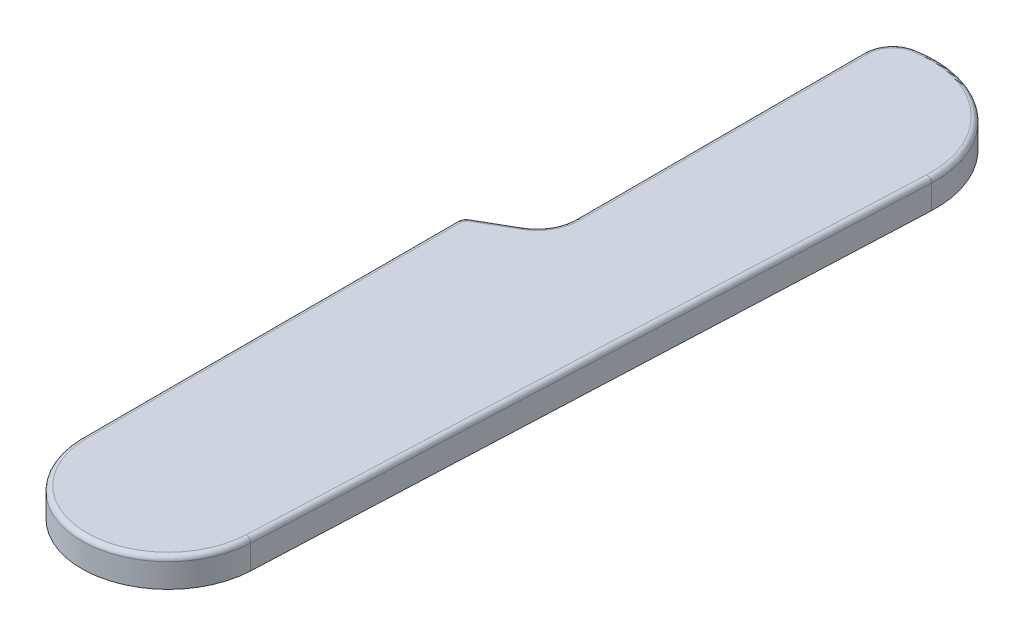
ISO-10303-21;
HEADER;
FILE_DESCRIPTION(('STEP AP214'),'2;1');
FILE_NAME('part.step','',(''),(''),'','','');
FILE_SCHEMA(('AUTOMOTIVE_DESIGN { 1 0 10303 214 1 1 1 1 }'));
ENDSEC;
DATA;
#1=APPLICATION_CONTEXT('core data for automotive mechanical design processes');
#2=APPLICATION_PROTOCOL_DEFINITION('international standard','automotive_design',2000,#1);
#3=PRODUCT_CONTEXT('',#1,'mechanical');
#4=PRODUCT('Part','Part','',(#3));
#5=PRODUCT_RELATED_PRODUCT_CATEGORY('part','',(#4));
#6=PRODUCT_DEFINITION_FORMATION('','',#4);
#7=PRODUCT_DEFINITION_CONTEXT('part definition',#1,'design');
#8=PRODUCT_DEFINITION('design','',#6,#7);
#9=PRODUCT_DEFINITION_SHAPE('','',#8);
#10=(LENGTH_UNIT() NAMED_UNIT(*) SI_UNIT(.MILLI.,.METRE.));
#11=(NAMED_UNIT(*) PLANE_ANGLE_UNIT() SI_UNIT($,.RADIAN.));
#12=(NAMED_UNIT(*) SI_UNIT($,.STERADIAN.) SOLID_ANGLE_UNIT());
#13=UNCERTAINTY_MEASURE_WITH_UNIT(LENGTH_MEASURE(1.E-05),#10,'distance_accuracy_value','');
#14=(GEOMETRIC_REPRESENTATION_CONTEXT(3) GLOBAL_UNCERTAINTY_ASSIGNED_CONTEXT((#13)) GLOBAL_UNIT_ASSIGNED_CONTEXT((#10,
#11,#12)) REPRESENTATION_CONTEXT('',''));
#15=CARTESIAN_POINT('',(0.,0.,0.));
#16=DIRECTION('',(0.,0.,1.));
#17=DIRECTION('',(1.,0.,0.));
#18=AXIS2_PLACEMENT_3D('',#15,#16,#17);
#19=CARTESIAN_POINT('',(-2.99888083783223,3.,-43.087780912381));
#20=DIRECTION('',(-1.,0.,0.));
#21=DIRECTION('',(0.,0.,1.));
#22=AXIS2_PLACEMENT_3D('',#19,#20,#21);
#23=PLANE('',#22);
#24=DIRECTION('',(0.,-1.,0.));
#25=VECTOR('',#24,1.);
#26=CARTESIAN_POINT('',(-2.99888083783231,3.,-45.3971819891395));
#27=LINE('',#26,#25);
#28=CARTESIAN_POINT('',(-2.99888083783231,0.,-45.3971819891395));
#29=VERTEX_POINT('',#28);
#30=CARTESIAN_POINT('',(-2.99888083783231,2.5,-45.3971819891395));
#31=VERTEX_POINT('',#30);
#32=EDGE_CURVE('E189',#29,#31,#27,.F.);
#33=ORIENTED_EDGE('',*,*,#32,.T.);
#34=DIRECTION('',(0.,0.,-1.));
#35=VECTOR('',#34,1.);
#36=CARTESIAN_POINT('',(-2.99888083783227,2.5,-75.448876402048));
#37=LINE('',#36,#35);
#38=CARTESIAN_POINT('',(-2.99888083783227,2.5,-75.448876402048));
#39=VERTEX_POINT('',#38);
#40=EDGE_CURVE('E235',#31,#39,#37,.T.);
#41=ORIENTED_EDGE('',*,*,#40,.T.);
#42=DIRECTION('',(0.,-1.,0.));
#43=VECTOR('',#42,1.);
#44=CARTESIAN_POINT('',(-2.99888083783227,3.,-75.448876402048));
#45=LINE('',#44,#43);
#46=CARTESIAN_POINT('',(-2.99888083783227,0.,-75.448876402048));
#47=VERTEX_POINT('',#46);
#48=EDGE_CURVE('E193',#39,#47,#45,.T.);
#49=ORIENTED_EDGE('',*,*,#48,.T.);
#50=DIRECTION('',(0.,0.,-1.));
#51=VECTOR('',#50,1.);
#52=CARTESIAN_POINT('',(-2.99888083783223,0.,-43.087780912381));
#53=LINE('',#52,#51);
#54=EDGE_CURVE('E170',#29,#47,#53,.T.);
#55=ORIENTED_EDGE('',*,*,#54,.F.);
#56=EDGE_LOOP('',(#33,#41,#49,#55));
#57=FACE_BOUND('',#56,.T.);
#58=ADVANCED_FACE('F48',(#57),#23,.T.);
#59=CARTESIAN_POINT('',(-8.99888083783227,3.,-39.6236792972433));
#60=DIRECTION('',(-0.499999999999998,0.,-0.866025403784441));
#61=DIRECTION('',(-0.866025403784441,0.,0.499999999999998));
#62=AXIS2_PLACEMENT_3D('',#59,#60,#61);
#63=PLANE('',#62);
#64=DIRECTION('',(0.,-1.,0.));
#65=VECTOR('',#64,1.);
#66=CARTESIAN_POINT('',(-8.4988808378323,3.,-39.9123544318381));
#67=LINE('',#66,#65);
#68=CARTESIAN_POINT('',(-8.4988808378323,0.,-39.9123544318381));
#69=VERTEX_POINT('',#68);
#70=CARTESIAN_POINT('',(-8.4988808378323,2.5,-39.9123544318381));
#71=VERTEX_POINT('',#70);
#72=EDGE_CURVE('E202',#69,#71,#67,.F.);
#73=ORIENTED_EDGE('',*,*,#72,.T.);
#74=DIRECTION('',(0.866025403784441,0.,-0.499999999999998));
#75=VECTOR('',#74,1.);
#76=CARTESIAN_POINT('',(-4.99888083783232,2.5,-41.9330803740018));
#77=LINE('',#76,#75);
#78=CARTESIAN_POINT('',(-4.99888083783232,2.5,-41.9330803740018));
#79=VERTEX_POINT('',#78);
#80=EDGE_CURVE('E13',#71,#79,#77,.T.);
#81=ORIENTED_EDGE('',*,*,#80,.T.);
#82=DIRECTION('',(0.,-1.,0.));
#83=VECTOR('',#82,1.);
#84=CARTESIAN_POINT('',(-4.99888083783232,0.,-41.9330803740018));
#85=LINE('',#84,#83);
#86=CARTESIAN_POINT('',(-4.99888083783232,0.,-41.9330803740018));
#87=VERTEX_POINT('',#86);
#88=EDGE_CURVE('E186',#79,#87,#85,.T.);
#89=ORIENTED_EDGE('',*,*,#88,.T.);
#90=DIRECTION('',(0.86602540378444,0.,-0.499999999999998));
#91=VECTOR('',#90,1.);
#92=CARTESIAN_POINT('',(-8.99888083783227,0.,-39.6236792972433));
#93=LINE('',#92,#91);
#94=EDGE_CURVE('E159',#69,#87,#93,.T.);
#95=ORIENTED_EDGE('',*,*,#94,.F.);
#96=EDGE_LOOP('',(#73,#81,#89,#95));
#97=FACE_BOUND('',#96,.T.);
#98=ADVANCED_FACE('F288',(#97),#63,.T.);
#99=CARTESIAN_POINT('',(-8.9988808378323,3.,0.141928385090591));
#100=DIRECTION('',(-1.,0.,0.));
#101=DIRECTION('',(0.,0.,1.));
#102=AXIS2_PLACEMENT_3D('',#99,#100,#101);
#103=PLANE('',#102);
#104=DIRECTION('',(0.,-1.,0.));
#105=VECTOR('',#104,1.);
#106=CARTESIAN_POINT('',(-8.99888083783231,3.,0.141928385090587));
#107=LINE('',#106,#105);
#108=CARTESIAN_POINT('',(-8.99888083783231,2.5,0.141928385090587));
#109=VERTEX_POINT('',#108);
#110=CARTESIAN_POINT('',(-8.99888083783231,0.,0.141928385090587));
#111=VERTEX_POINT('',#110);
#112=EDGE_CURVE('E184',#109,#111,#107,.T.);
#113=ORIENTED_EDGE('',*,*,#112,.F.);
#114=DIRECTION('',(0.,0.,-1.));
#115=VECTOR('',#114,1.);
#116=CARTESIAN_POINT('',(-8.99888083783227,2.5,-39.0463290280537));
#117=LINE('',#116,#115);
#118=CARTESIAN_POINT('',(-8.99888083783227,2.5,-39.0463290280537));
#119=VERTEX_POINT('',#118);
#120=EDGE_CURVE('E204',#109,#119,#117,.T.);
#121=ORIENTED_EDGE('',*,*,#120,.T.);
#122=DIRECTION('',(0.,-1.,0.));
#123=VECTOR('',#122,1.);
#124=CARTESIAN_POINT('',(-8.99888083783227,3.,-39.0463290280537));
#125=LINE('',#124,#123);
#126=CARTESIAN_POINT('',(-8.99888083783227,0.,-39.0463290280537));
#127=VERTEX_POINT('',#126);
#128=EDGE_CURVE('E198',#119,#127,#125,.T.);
#129=ORIENTED_EDGE('',*,*,#128,.T.);
#130=DIRECTION('',(0.,0.,-1.));
#131=VECTOR('',#130,1.);
#132=CARTESIAN_POINT('',(-8.9988808378323,0.,0.141928385090591));
#133=LINE('',#132,#131);
#134=EDGE_CURVE('E177',#111,#127,#133,.T.);
#135=ORIENTED_EDGE('',*,*,#134,.F.);
#136=EDGE_LOOP('',(#113,#121,#129,#135));
#137=FACE_BOUND('',#136,.T.);
#138=ADVANCED_FACE('F294',(#137),#103,.T.);
#139=CARTESIAN_POINT('',(0.,3.,0.));
#140=DIRECTION('',(0.,-1.,0.));
#141=DIRECTION('',(0.,0.,-1.));
#142=AXIS2_PLACEMENT_3D('',#139,#140,#141);
#143=CYLINDRICAL_SURFACE('',#142,9.);
#144=DIRECTION('',(0.,-1.,0.));
#145=VECTOR('',#144,1.);
#146=CARTESIAN_POINT('',(8.99143399423672,3.,0.392574486288027));
#147=LINE('',#146,#145);
#148=CARTESIAN_POINT('',(8.99143399423672,2.5,0.392574486288027));
#149=VERTEX_POINT('',#148);
#150=CARTESIAN_POINT('',(8.99143399423672,0.,0.392574486288027));
#151=VERTEX_POINT('',#150);
#152=EDGE_CURVE('E158',#149,#151,#147,.T.);
#153=ORIENTED_EDGE('',*,*,#152,.F.);
#154=CARTESIAN_POINT('',(0.,2.5,0.));
#155=DIRECTION('',(0.,-1.,0.));
#156=DIRECTION('',(0.,0.,-1.));
#157=AXIS2_PLACEMENT_3D('',#154,#155,#156);
#158=CIRCLE('',#157,9.);
#159=EDGE_CURVE('E228',#149,#109,#158,.T.);
#160=ORIENTED_EDGE('',*,*,#159,.T.);
#161=ORIENTED_EDGE('',*,*,#112,.T.);
#162=CARTESIAN_POINT('',(0.,0.,0.));
#163=DIRECTION('',(0.,1.,0.));
#164=DIRECTION('',(0.,0.,1.));
#165=AXIS2_PLACEMENT_3D('',#162,#163,#164);
#166=CIRCLE('',#165,9.);
#167=EDGE_CURVE('E175',#111,#151,#166,.T.);
#168=ORIENTED_EDGE('',*,*,#167,.T.);
#169=EDGE_LOOP('',(#153,#160,#161,#168));
#170=FACE_BOUND('',#169,.T.);
#171=ADVANCED_FACE('F403',(#170),#143,.T.);
#172=CARTESIAN_POINT('',(8.99143399423672,3.,0.392574486288027));
#173=DIRECTION('',(-0.999048221581858,0.,-0.0436193873653361));
#174=DIRECTION('',(-0.0436193873653361,0.,0.999048221581858));
#175=AXIS2_PLACEMENT_3D('',#172,#173,#174);
#176=PLANE('',#175);
#177=DIRECTION('',(0.,-1.,0.));
#178=VECTOR('',#177,1.);
#179=CARTESIAN_POINT('',(11.9573742369389,3.,-67.5386254632291));
#180=LINE('',#179,#178);
#181=CARTESIAN_POINT('',(11.9573742369389,2.5,-67.5386254632291));
#182=VERTEX_POINT('',#181);
#183=CARTESIAN_POINT('',(11.9573742369389,0.,-67.5386254632291));
#184=VERTEX_POINT('',#183);
#185=EDGE_CURVE('E147',#182,#184,#180,.T.);
#186=ORIENTED_EDGE('',*,*,#185,.F.);
#187=DIRECTION('',(0.0436193873653361,0.,-0.999048221581858));
#188=VECTOR('',#187,1.);
#189=CARTESIAN_POINT('',(8.99143399423672,2.5,0.392574486288027));
#190=LINE('',#189,#188);
#191=EDGE_CURVE('E230',#182,#149,#190,.F.);
#192=ORIENTED_EDGE('',*,*,#191,.T.);
#193=ORIENTED_EDGE('',*,*,#152,.T.);
#194=DIRECTION('',(0.0436193873653361,0.,-0.999048221581858));
#195=VECTOR('',#194,1.);
#196=CARTESIAN_POINT('',(8.99143399423672,0.,0.392574486288027));
#197=LINE('',#196,#195);
#198=EDGE_CURVE('E166',#151,#184,#197,.T.);
#199=ORIENTED_EDGE('',*,*,#198,.T.);
#200=EDGE_LOOP('',(#186,#192,#193,#199));
#201=FACE_BOUND('',#200,.T.);
#202=ADVANCED_FACE('F172',(#201),#176,.F.);
#203=CARTESIAN_POINT('',(1.3901600167217,3.,-68.));
#204=DIRECTION('',(0.,-1.,0.));
#205=DIRECTION('',(0.,0.,-1.));
#206=AXIS2_PLACEMENT_3D('',#203,#204,#205);
#207=CYLINDRICAL_SURFACE('',#206,10.5772814484225);
#208=DIRECTION('',(0.,-1.,0.));
#209=VECTOR('',#208,1.);
#210=CARTESIAN_POINT('',(-0.548830393227166,3.,-78.3980382298426));
#211=LINE('',#210,#209);
#212=CARTESIAN_POINT('',(-0.548830393227166,0.,-78.3980382298426));
#213=VERTEX_POINT('',#212);
#214=CARTESIAN_POINT('',(-0.548830393227166,2.5,-78.3980382298426));
#215=VERTEX_POINT('',#214);
#216=EDGE_CURVE('E196',#213,#215,#211,.F.);
#217=ORIENTED_EDGE('',*,*,#216,.T.);
#218=CARTESIAN_POINT('',(1.3901600167217,2.5,-68.));
#219=DIRECTION('',(0.,-1.,0.));
#220=DIRECTION('',(0.,0.,-1.));
#221=AXIS2_PLACEMENT_3D('',#218,#219,#220);
#222=CIRCLE('',#221,10.5772814484225);
#223=EDGE_CURVE('E154',#215,#182,#222,.T.);
#224=ORIENTED_EDGE('',*,*,#223,.T.);
#225=ORIENTED_EDGE('',*,*,#185,.T.);
#226=CARTESIAN_POINT('',(1.3901600167217,0.,-68.));
#227=DIRECTION('',(0.,-1.,0.));
#228=DIRECTION('',(0.,0.,-1.));
#229=AXIS2_PLACEMENT_3D('',#226,#227,#228);
#230=CIRCLE('',#229,10.5772814484225);
#231=EDGE_CURVE('E151',#213,#184,#230,.T.);
#232=ORIENTED_EDGE('',*,*,#231,.F.);
#233=EDGE_LOOP('',(#217,#224,#225,#232));
#234=FACE_BOUND('',#233,.T.);
#235=ADVANCED_FACE('F150',(#234),#207,.T.);
#236=CARTESIAN_POINT('',(1.3901600167217,3.,-68.));
#237=DIRECTION('',(0.,-1.,0.));
#238=DIRECTION('',(0.,0.,-1.));
#239=AXIS2_PLACEMENT_3D('',#236,#237,#238);
#240=PLANE('',#239);
#241=CARTESIAN_POINT('',(-7.99888083783227,3.,-39.0463290280537));
#242=DIRECTION('',(0.,-1.,0.));
#243=DIRECTION('',(0.,0.,-1.));
#244=AXIS2_PLACEMENT_3D('',#241,#242,#243);
#245=CIRCLE('',#244,0.5);
#246=CARTESIAN_POINT('',(-8.24888083783226,3.,-39.4793417299459));
#247=VERTEX_POINT('',#246);
#248=CARTESIAN_POINT('',(-8.49888083783231,3.,-39.0463290280537));
#249=VERTEX_POINT('',#248);
#250=EDGE_CURVE('E221',#247,#249,#245,.F.);
#251=ORIENTED_EDGE('',*,*,#250,.T.);
#252=DIRECTION('',(0.,0.,-1.));
#253=VECTOR('',#252,1.);
#254=CARTESIAN_POINT('',(-8.49888083783224,3.,0.141928385090612));
#255=LINE('',#254,#253);
#256=CARTESIAN_POINT('',(-8.49888083783227,3.,0.13792934541542));
#257=VERTEX_POINT('',#256);
#258=EDGE_CURVE('E223',#249,#257,#255,.F.);
#259=ORIENTED_EDGE('',*,*,#258,.T.);
#260=CARTESIAN_POINT('',(0.,3.,0.));
#261=DIRECTION('',(0.,-1.,0.));
#262=DIRECTION('',(0.,0.,-1.));
#263=AXIS2_PLACEMENT_3D('',#260,#261,#262);
#264=CIRCLE('',#263,8.5);
#265=CARTESIAN_POINT('',(8.49190988344583,3.,0.370764792605355));
#266=VERTEX_POINT('',#265);
#267=EDGE_CURVE('E219',#257,#266,#264,.F.);
#268=ORIENTED_EDGE('',*,*,#267,.T.);
#269=DIRECTION('',(0.0436193873653361,0.,-0.999048221581858));
#270=VECTOR('',#269,1.);
#271=CARTESIAN_POINT('',(11.4578501261485,3.,-67.5604351569118));
#272=LINE('',#271,#270);
#273=CARTESIAN_POINT('',(11.457850126148,3.,-67.5604351569118));
#274=VERTEX_POINT('',#273);
#275=EDGE_CURVE('E217',#266,#274,#272,.T.);
#276=ORIENTED_EDGE('',*,*,#275,.T.);
#277=CARTESIAN_POINT('',(1.3901600167217,3.,-68.));
#278=DIRECTION('',(0.,-1.,0.));
#279=DIRECTION('',(0.,0.,-1.));
#280=AXIS2_PLACEMENT_3D('',#277,#278,#279);
#281=CIRCLE('',#280,10.0772814484225);
#282=CARTESIAN_POINT('',(-0.457172133994682,3.,-77.9065112585435));
#283=VERTEX_POINT('',#282);
#284=EDGE_CURVE('E215',#274,#283,#281,.F.);
#285=ORIENTED_EDGE('',*,*,#284,.T.);
#286=CARTESIAN_POINT('',(0.00111916216773145,3.,-75.448876402048));
#287=DIRECTION('',(0.,-1.,0.));
#288=DIRECTION('',(0.,0.,-1.));
#289=AXIS2_PLACEMENT_3D('',#286,#287,#288);
#290=CIRCLE('',#289,2.5);
#291=CARTESIAN_POINT('',(-2.49888083783223,3.,-75.448876402048));
#292=VERTEX_POINT('',#291);
#293=EDGE_CURVE('E213',#283,#292,#290,.F.);
#294=ORIENTED_EDGE('',*,*,#293,.T.);
#295=DIRECTION('',(0.,0.,-1.));
#296=VECTOR('',#295,1.);
#297=CARTESIAN_POINT('',(-2.49888083783231,3.,-45.3971819891395));
#298=LINE('',#297,#296);
#299=CARTESIAN_POINT('',(-2.49888083783231,3.,-45.3971819891395));
#300=VERTEX_POINT('',#299);
#301=EDGE_CURVE('E211',#292,#300,#298,.F.);
#302=ORIENTED_EDGE('',*,*,#301,.T.);
#303=CARTESIAN_POINT('',(-6.99888083783227,3.,-45.3971819891395));
#304=DIRECTION('',(0.,-1.,0.));
#305=DIRECTION('',(0.,0.,-1.));
#306=AXIS2_PLACEMENT_3D('',#303,#304,#305);
#307=CIRCLE('',#306,4.5);
#308=CARTESIAN_POINT('',(-4.74888083783225,3.,-41.5000676721096));
#309=VERTEX_POINT('',#308);
#310=EDGE_CURVE('E209',#300,#309,#307,.T.);
#311=ORIENTED_EDGE('',*,*,#310,.T.);
#312=DIRECTION('',(0.866025403784441,0.,-0.499999999999998));
#313=VECTOR('',#312,1.);
#314=CARTESIAN_POINT('',(-8.24888083783225,3.,-39.4793417299459));
#315=LINE('',#314,#313);
#316=EDGE_CURVE('E207',#309,#247,#315,.F.);
#317=ORIENTED_EDGE('',*,*,#316,.T.);
#318=EDGE_LOOP('',(#251,#259,#268,#276,#285,#294,#302,#311,#317));
#319=FACE_BOUND('',#318,.T.);
#320=ADVANCED_FACE('F377',(#319),#240,.F.);
#321=CARTESIAN_POINT('',(1.3901600167217,0.,-68.));
#322=DIRECTION('',(0.,-1.,0.));
#323=DIRECTION('',(0.,0.,-1.));
#324=AXIS2_PLACEMENT_3D('',#321,#322,#323);
#325=PLANE('',#324);
#326=CARTESIAN_POINT('',(6.9164635945933,0.,-69.4822668018044));
#327=DIRECTION('',(0.,-1.,0.));
#328=DIRECTION('',(0.,0.,-1.));
#329=AXIS2_PLACEMENT_3D('',#326,#327,#328);
#330=CIRCLE('',#329,1.00000000000001);
#331=CARTESIAN_POINT('',(6.9164635945933,0.,-70.4822668018044));
#332=VERTEX_POINT('',#331);
#333=EDGE_CURVE('E360',#332,#332,#330,.T.);
#334=ORIENTED_EDGE('',*,*,#333,.F.);
#335=EDGE_LOOP('',(#334));
#336=FACE_BOUND('',#335,.T.);
#337=CARTESIAN_POINT('',(2.7408492822206,0.,-1.61059196528434));
#338=DIRECTION('',(0.,-1.,0.));
#339=DIRECTION('',(0.,0.,-1.));
#340=AXIS2_PLACEMENT_3D('',#337,#338,#339);
#341=CIRCLE('',#340,1.);
#342=CARTESIAN_POINT('',(2.7408492822206,0.,-2.61059196528434));
#343=VERTEX_POINT('',#342);
#344=EDGE_CURVE('E354',#343,#343,#341,.T.);
#345=ORIENTED_EDGE('',*,*,#344,.F.);
#346=EDGE_LOOP('',(#345));
#347=FACE_BOUND('',#346,.T.);
#348=CARTESIAN_POINT('',(-5.99999999999962,0.,-35.3553391064268));
#349=DIRECTION('',(0.,-1.,0.));
#350=DIRECTION('',(0.,0.,-1.));
#351=AXIS2_PLACEMENT_3D('',#348,#349,#350);
#352=CIRCLE('',#351,1.);
#353=CARTESIAN_POINT('',(-5.99999999999962,0.,-36.3553391064268));
#354=VERTEX_POINT('',#353);
#355=EDGE_CURVE('E348',#354,#354,#352,.T.);
#356=ORIENTED_EDGE('',*,*,#355,.F.);
#357=EDGE_LOOP('',(#356));
#358=FACE_BOUND('',#357,.T.);
#359=ORIENTED_EDGE('',*,*,#134,.T.);
#360=CARTESIAN_POINT('',(-7.99888083783227,0.,-39.0463290280537));
#361=DIRECTION('',(0.,-1.,0.));
#362=DIRECTION('',(0.,0.,-1.));
#363=AXIS2_PLACEMENT_3D('',#360,#361,#362);
#364=CIRCLE('',#363,1.);
#365=EDGE_CURVE('E200',#127,#69,#364,.T.);
#366=ORIENTED_EDGE('',*,*,#365,.T.);
#367=ORIENTED_EDGE('',*,*,#94,.T.);
#368=CARTESIAN_POINT('',(-6.99888083783227,0.,-45.3971819891395));
#369=DIRECTION('',(0.,-1.,0.));
#370=DIRECTION('',(0.,0.,-1.));
#371=AXIS2_PLACEMENT_3D('',#368,#369,#370);
#372=CIRCLE('',#371,4.);
#373=EDGE_CURVE('E191',#87,#29,#372,.F.);
#374=ORIENTED_EDGE('',*,*,#373,.T.);
#375=ORIENTED_EDGE('',*,*,#54,.T.);
#376=CARTESIAN_POINT('',(0.00111916216773145,0.,-75.448876402048));
#377=DIRECTION('',(0.,-1.,0.));
#378=DIRECTION('',(0.,0.,-1.));
#379=AXIS2_PLACEMENT_3D('',#376,#377,#378);
#380=CIRCLE('',#379,3.);
#381=EDGE_CURVE('E169',#47,#213,#380,.T.);
#382=ORIENTED_EDGE('',*,*,#381,.T.);
#383=ORIENTED_EDGE('',*,*,#231,.T.);
#384=ORIENTED_EDGE('',*,*,#198,.F.);
#385=ORIENTED_EDGE('',*,*,#167,.F.);
#386=EDGE_LOOP('',(#359,#366,#367,#374,#375,#382,#383,#384,#385));
#387=FACE_BOUND('',#386,.T.);
#388=ADVANCED_FACE('F164',(#336,#347,#358,#387),#325,.T.);
#389=CARTESIAN_POINT('',(-6.99888083783227,3.,-45.3971819891395));
#390=DIRECTION('',(0.,1.,0.));
#391=DIRECTION('',(0.,0.,1.));
#392=AXIS2_PLACEMENT_3D('',#389,#390,#391);
#393=CYLINDRICAL_SURFACE('',#392,4.);
#394=ORIENTED_EDGE('',*,*,#88,.F.);
#395=CARTESIAN_POINT('',(-6.99888083783227,2.5,-45.3971819891395));
#396=DIRECTION('',(0.,-1.,0.));
#397=DIRECTION('',(0.,0.,-1.));
#398=AXIS2_PLACEMENT_3D('',#395,#396,#397);
#399=CIRCLE('',#398,4.);
#400=EDGE_CURVE('E57',#79,#31,#399,.F.);
#401=ORIENTED_EDGE('',*,*,#400,.T.);
#402=ORIENTED_EDGE('',*,*,#32,.F.);
#403=ORIENTED_EDGE('',*,*,#373,.F.);
#404=EDGE_LOOP('',(#394,#401,#402,#403));
#405=FACE_BOUND('',#404,.T.);
#406=ADVANCED_FACE('F299',(#405),#393,.F.);
#407=CARTESIAN_POINT('',(0.00111916216773145,3.,-75.448876402048));
#408=DIRECTION('',(0.,-1.,0.));
#409=DIRECTION('',(0.,0.,-1.));
#410=AXIS2_PLACEMENT_3D('',#407,#408,#409);
#411=CYLINDRICAL_SURFACE('',#410,3.);
#412=ORIENTED_EDGE('',*,*,#48,.F.);
#413=CARTESIAN_POINT('',(0.00111916216773145,2.5,-75.448876402048));
#414=DIRECTION('',(0.,-1.,0.));
#415=DIRECTION('',(0.,0.,-1.));
#416=AXIS2_PLACEMENT_3D('',#413,#414,#415);
#417=CIRCLE('',#416,3.);
#418=EDGE_CURVE('E233',#39,#215,#417,.T.);
#419=ORIENTED_EDGE('',*,*,#418,.T.);
#420=ORIENTED_EDGE('',*,*,#216,.F.);
#421=ORIENTED_EDGE('',*,*,#381,.F.);
#422=EDGE_LOOP('',(#412,#419,#420,#421));
#423=FACE_BOUND('',#422,.T.);
#424=ADVANCED_FACE('F302',(#423),#411,.T.);
#425=CARTESIAN_POINT('',(-7.99888083783227,3.,-39.0463290280537));
#426=DIRECTION('',(0.,-1.,0.));
#427=DIRECTION('',(0.,0.,-1.));
#428=AXIS2_PLACEMENT_3D('',#425,#426,#427);
#429=CYLINDRICAL_SURFACE('',#428,1.);
#430=ORIENTED_EDGE('',*,*,#128,.F.);
#431=CARTESIAN_POINT('',(-7.99888083783227,2.5,-39.0463290280537));
#432=DIRECTION('',(0.,-1.,0.));
#433=DIRECTION('',(0.,0.,-1.));
#434=AXIS2_PLACEMENT_3D('',#431,#432,#433);
#435=CIRCLE('',#434,1.);
#436=EDGE_CURVE('E226',#119,#71,#435,.T.);
#437=ORIENTED_EDGE('',*,*,#436,.T.);
#438=ORIENTED_EDGE('',*,*,#72,.F.);
#439=ORIENTED_EDGE('',*,*,#365,.F.);
#440=EDGE_LOOP('',(#430,#437,#438,#439));
#441=FACE_BOUND('',#440,.T.);
#442=ADVANCED_FACE('F284',(#441),#429,.T.);
#443=CARTESIAN_POINT('',(0.00111916216773145,2.5,-75.448876402048));
#444=DIRECTION('',(0.,-1.,0.));
#445=DIRECTION('',(0.,0.,-1.));
#446=AXIS2_PLACEMENT_3D('',#443,#444,#445);
#447=TOROIDAL_SURFACE('',#446,2.5,0.5);
#448=CARTESIAN_POINT('',(-0.457172133994682,2.5,-77.9065112585435));
#449=DIRECTION('',(0.98305394259821,0.,-0.183316518464966));
#450=DIRECTION('',(-0.183316518464966,0.,-0.98305394259821));
#451=AXIS2_PLACEMENT_3D('',#448,#449,#450);
#452=CIRCLE('',#451,0.5);
#453=EDGE_CURVE('E339',#215,#283,#452,.T.);
#454=ORIENTED_EDGE('',*,*,#453,.F.);
#455=ORIENTED_EDGE('',*,*,#418,.F.);
#456=CARTESIAN_POINT('',(-2.49888083783223,2.5,-75.448876402048));
#457=DIRECTION('',(0.,0.,1.));
#458=DIRECTION('',(1.,0.,0.));
#459=AXIS2_PLACEMENT_3D('',#456,#457,#458);
#460=CIRCLE('',#459,0.5);
#461=EDGE_CURVE('E52',#292,#39,#460,.T.);
#462=ORIENTED_EDGE('',*,*,#461,.F.);
#463=ORIENTED_EDGE('',*,*,#293,.F.);
#464=EDGE_LOOP('',(#454,#455,#462,#463));
#465=FACE_BOUND('',#464,.T.);
#466=ADVANCED_FACE('F50',(#465),#447,.T.);
#467=CARTESIAN_POINT('',(-2.49888083783231,2.5,-43.0877809123811));
#468=DIRECTION('',(0.,0.,1.));
#469=DIRECTION('',(1.,0.,0.));
#470=AXIS2_PLACEMENT_3D('',#467,#468,#469);
#471=CYLINDRICAL_SURFACE('',#470,0.5);
#472=ORIENTED_EDGE('',*,*,#461,.T.);
#473=ORIENTED_EDGE('',*,*,#40,.F.);
#474=CARTESIAN_POINT('',(-2.49888083783231,2.5,-45.3971819891395));
#475=DIRECTION('',(0.,0.,1.));
#476=DIRECTION('',(1.,0.,0.));
#477=AXIS2_PLACEMENT_3D('',#474,#475,#476);
#478=CIRCLE('',#477,0.5);
#479=EDGE_CURVE('E337',#300,#31,#478,.T.);
#480=ORIENTED_EDGE('',*,*,#479,.F.);
#481=ORIENTED_EDGE('',*,*,#301,.F.);
#482=EDGE_LOOP('',(#472,#473,#480,#481));
#483=FACE_BOUND('',#482,.T.);
#484=ADVANCED_FACE('F277',(#483),#471,.T.);
#485=CARTESIAN_POINT('',(1.3901600167217,2.5,-68.));
#486=DIRECTION('',(0.,-1.,0.));
#487=DIRECTION('',(0.,0.,-1.));
#488=AXIS2_PLACEMENT_3D('',#485,#486,#487);
#489=TOROIDAL_SURFACE('',#488,10.0772814484225,0.5);
#490=ORIENTED_EDGE('',*,*,#453,.T.);
#491=ORIENTED_EDGE('',*,*,#284,.F.);
#492=CARTESIAN_POINT('',(11.457850126148,2.5,-67.5604351569118));
#493=DIRECTION('',(-0.0436193873653289,0.,0.999048221581858));
#494=DIRECTION('',(0.999048221581858,0.,0.0436193873653289));
#495=AXIS2_PLACEMENT_3D('',#492,#493,#494);
#496=CIRCLE('',#495,0.5);
#497=EDGE_CURVE('E332',#182,#274,#496,.T.);
#498=ORIENTED_EDGE('',*,*,#497,.F.);
#499=ORIENTED_EDGE('',*,*,#223,.F.);
#500=EDGE_LOOP('',(#490,#491,#498,#499));
#501=FACE_BOUND('',#500,.T.);
#502=ADVANCED_FACE('F274',(#501),#489,.T.);
#503=CARTESIAN_POINT('',(-6.99888083783227,2.5,-45.3971819891395));
#504=DIRECTION('',(0.,-1.,0.));
#505=DIRECTION('',(0.,0.,-1.));
#506=AXIS2_PLACEMENT_3D('',#503,#504,#505);
#507=TOROIDAL_SURFACE('',#506,4.5,0.5);
#508=ORIENTED_EDGE('',*,*,#479,.T.);
#509=ORIENTED_EDGE('',*,*,#400,.F.);
#510=CARTESIAN_POINT('',(-4.74888083783225,2.5,-41.5000676721096));
#511=DIRECTION('',(-0.866025403784441,0.,0.499999999999997));
#512=DIRECTION('',(0.499999999999997,0.,0.866025403784441));
#513=AXIS2_PLACEMENT_3D('',#510,#511,#512);
#514=CIRCLE('',#513,0.5);
#515=EDGE_CURVE('E328',#309,#79,#514,.T.);
#516=ORIENTED_EDGE('',*,*,#515,.F.);
#517=ORIENTED_EDGE('',*,*,#310,.F.);
#518=EDGE_LOOP('',(#508,#509,#516,#517));
#519=FACE_BOUND('',#518,.T.);
#520=ADVANCED_FACE('F270',(#519),#507,.T.);
#521=CARTESIAN_POINT('',(11.4578501261485,2.5,-67.5604351569118));
#522=DIRECTION('',(0.0436193873653361,0.,-0.999048221581858));
#523=DIRECTION('',(-0.999048221581858,0.,-0.0436193873653361));
#524=AXIS2_PLACEMENT_3D('',#521,#522,#523);
#525=CYLINDRICAL_SURFACE('',#524,0.5);
#526=ORIENTED_EDGE('',*,*,#497,.T.);
#527=ORIENTED_EDGE('',*,*,#275,.F.);
#528=CARTESIAN_POINT('',(8.49190988344583,2.5,0.370764792605355));
#529=DIRECTION('',(-0.0436193873653361,0.,0.999048221581858));
#530=DIRECTION('',(0.999048221581858,0.,0.0436193873653361));
#531=AXIS2_PLACEMENT_3D('',#528,#529,#530);
#532=CIRCLE('',#531,0.5);
#533=EDGE_CURVE('E326',#149,#266,#532,.T.);
#534=ORIENTED_EDGE('',*,*,#533,.F.);
#535=ORIENTED_EDGE('',*,*,#191,.F.);
#536=EDGE_LOOP('',(#526,#527,#534,#535));
#537=FACE_BOUND('',#536,.T.);
#538=ADVANCED_FACE('F266',(#537),#525,.T.);
#539=CARTESIAN_POINT('',(-8.74888083783227,2.5,-39.1906665953511));
#540=DIRECTION('',(-0.866025403784441,0.,0.499999999999998));
#541=DIRECTION('',(0.499999999999998,0.,0.866025403784441));
#542=AXIS2_PLACEMENT_3D('',#539,#540,#541);
#543=CYLINDRICAL_SURFACE('',#542,0.5);
#544=ORIENTED_EDGE('',*,*,#515,.T.);
#545=ORIENTED_EDGE('',*,*,#80,.F.);
#546=CARTESIAN_POINT('',(-8.24888083783226,2.5,-39.4793417299459));
#547=DIRECTION('',(-0.866025403784442,0.,0.499999999999996));
#548=DIRECTION('',(0.499999999999996,0.,0.866025403784442));
#549=AXIS2_PLACEMENT_3D('',#546,#547,#548);
#550=CIRCLE('',#549,0.5);
#551=EDGE_CURVE('E249',#247,#71,#550,.T.);
#552=ORIENTED_EDGE('',*,*,#551,.F.);
#553=ORIENTED_EDGE('',*,*,#316,.F.);
#554=EDGE_LOOP('',(#544,#545,#552,#553));
#555=FACE_BOUND('',#554,.T.);
#556=ADVANCED_FACE('F259',(#555),#543,.T.);
#557=CARTESIAN_POINT('',(0.,2.5,0.));
#558=DIRECTION('',(0.,-1.,0.));
#559=DIRECTION('',(0.,0.,-1.));
#560=AXIS2_PLACEMENT_3D('',#557,#558,#559);
#561=TOROIDAL_SURFACE('',#560,8.5,0.5);
#562=ORIENTED_EDGE('',*,*,#533,.T.);
#563=ORIENTED_EDGE('',*,*,#267,.F.);
#564=CARTESIAN_POINT('',(-8.99888083783231,2.5,0.141928385090587));
#565=CARTESIAN_POINT('',(-8.99890473304675,2.52812732661308,0.141928558626583));
#566=CARTESIAN_POINT('',(-8.99650882982799,2.5562475175816,0.14190968059617));
#567=CARTESIAN_POINT('',(-8.98705333930275,2.61167328690149,0.141835098712566));
#568=CARTESIAN_POINT('',(-8.97999702469597,2.63897942285669,0.141779420701554));
#569=CARTESIAN_POINT('',(-8.96139165480188,2.69203127106294,0.141632477211946));
#570=CARTESIAN_POINT('',(-8.94984041937202,2.71777621908671,0.141541194464163));
#571=CARTESIAN_POINT('',(-8.92258451062589,2.7669548319342,0.141325518681682));
#572=CARTESIAN_POINT('',(-8.9068809611431,2.79038911979091,0.141201134605877));
#573=CARTESIAN_POINT('',(-8.87176469064576,2.83428696892004,0.140922527146798));
#574=CARTESIAN_POINT('',(-8.85235230834462,2.85475080117263,0.140768306488368));
#575=CARTESIAN_POINT('',(-8.81035717400536,2.89213902627984,0.14043403173945));
#576=CARTESIAN_POINT('',(-8.78777290321229,2.90906171385117,0.140253965272631));
#577=CARTESIAN_POINT('',(-8.740074849092,2.93888212402264,0.139872838938001));
#578=CARTESIAN_POINT('',(-8.71495968681416,2.95177763657048,0.139671767623535));
#579=CARTESIAN_POINT('',(-8.66294264717584,2.97315105554911,0.139254339944887));
#580=CARTESIAN_POINT('',(-8.63604353553469,2.98163562787804,0.139038007209306));
#581=CARTESIAN_POINT('',(-8.59636232230367,2.99056790653375,0.138718093393));
#582=CARTESIAN_POINT('',(-8.58397120197089,2.99286775957004,0.138618088103119));
#583=CARTESIAN_POINT('',(-8.55905995001841,2.99652436699758,0.138416815326112));
#584=CARTESIAN_POINT('',(-8.54653995933993,2.99788205937256,0.138315549196804));
#585=CARTESIAN_POINT('',(-8.52230345453715,2.99958878619069,0.138119299030325));
#586=CARTESIAN_POINT('',(-8.51059136640279,3.00000118251863,0.138024365805534));
#587=CARTESIAN_POINT('',(-8.49888083783227,3.,0.13792934541542));
#588=B_SPLINE_CURVE_WITH_KNOTS('',3,(#564,#565,#566,#567,#568,#569,#570,#571,#572,#573,#574,
#575,#576,#577,#578,#579,#580,#581,#582,#583,#584,#585,#586,#587),.UNSPECIFIED.,.F.,.F.,(4,2,2,
2,2,2,2,2,2,2,2,4),(0.,0.0842698950700343,0.168480675778625,0.252732351712825,0.33696124803372,
0.421182455727912,0.505444128351076,0.589751961565651,0.673932014056917,0.711713374228293,
0.74945706636563,0.784585939710143),.UNSPECIFIED.);
#589=EDGE_CURVE('E240',#109,#257,#588,.T.);
#590=ORIENTED_EDGE('',*,*,#589,.F.);
#591=ORIENTED_EDGE('',*,*,#159,.F.);
#592=EDGE_LOOP('',(#562,#563,#590,#591));
#593=FACE_BOUND('',#592,.T.);
#594=ADVANCED_FACE('F254',(#593),#561,.T.);
#595=CARTESIAN_POINT('',(-7.99888083783227,2.5,-39.0463290280537));
#596=DIRECTION('',(0.,-1.,0.));
#597=DIRECTION('',(0.,0.,-1.));
#598=AXIS2_PLACEMENT_3D('',#595,#596,#597);
#599=DEGENERATE_TOROIDAL_SURFACE('',#598,0.5,0.5,.T.);
#600=ORIENTED_EDGE('',*,*,#551,.T.);
#601=ORIENTED_EDGE('',*,*,#436,.F.);
#602=CARTESIAN_POINT('',(-8.49888083783231,2.5,-39.0463290280537));
#603=DIRECTION('',(0.,0.,1.));
#604=DIRECTION('',(1.,0.,0.));
#605=AXIS2_PLACEMENT_3D('',#602,#603,#604);
#606=CIRCLE('',#605,0.5);
#607=EDGE_CURVE('E238',#249,#119,#606,.T.);
#608=ORIENTED_EDGE('',*,*,#607,.F.);
#609=ORIENTED_EDGE('',*,*,#250,.F.);
#610=EDGE_LOOP('',(#600,#601,#608,#609));
#611=FACE_BOUND('',#610,.T.);
#612=ADVANCED_FACE('F258',(#611),#599,.T.);
#613=CARTESIAN_POINT('',(-8.49888083783227,2.5,0.141928385090612));
#614=DIRECTION('',(0.,0.,1.));
#615=DIRECTION('',(1.,0.,0.));
#616=AXIS2_PLACEMENT_3D('',#613,#614,#615);
#617=CYLINDRICAL_SURFACE('',#616,0.5);
#618=ORIENTED_EDGE('',*,*,#589,.T.);
#619=ORIENTED_EDGE('',*,*,#258,.F.);
#620=ORIENTED_EDGE('',*,*,#607,.T.);
#621=ORIENTED_EDGE('',*,*,#120,.F.);
#622=EDGE_LOOP('',(#618,#619,#620,#621));
#623=FACE_BOUND('',#622,.T.);
#624=ADVANCED_FACE('F251',(#623),#617,.T.);
#625=CARTESIAN_POINT('',(-5.99999999999962,2.3,-35.3553391064268));
#626=DIRECTION('',(0.,-1.,0.));
#627=DIRECTION('',(0.,0.,-1.));
#628=AXIS2_PLACEMENT_3D('',#625,#626,#627);
#629=CYLINDRICAL_SURFACE('',#628,1.);
#630=CARTESIAN_POINT('',(-5.99999999999962,2.3,-35.3553391064268));
#631=DIRECTION('',(0.,-1.,0.));
#632=DIRECTION('',(0.,0.,-1.));
#633=AXIS2_PLACEMENT_3D('',#630,#631,#632);
#634=CIRCLE('',#633,1.);
#635=CARTESIAN_POINT('',(-5.99999999999962,2.3,-36.3553391064268));
#636=VERTEX_POINT('',#635);
#637=EDGE_CURVE('E351',#636,#636,#634,.T.);
#638=ORIENTED_EDGE('',*,*,#637,.F.);
#639=EDGE_LOOP('',(#638));
#640=FACE_BOUND('',#639,.T.);
#641=ORIENTED_EDGE('',*,*,#355,.T.);
#642=EDGE_LOOP('',(#641));
#643=FACE_BOUND('',#642,.T.);
#644=ADVANCED_FACE('F383',(#640,#643),#629,.F.);
#645=CARTESIAN_POINT('',(-5.99999999999962,2.3,-35.3553391064268));
#646=DIRECTION('',(0.,-1.,0.));
#647=DIRECTION('',(0.,0.,-1.));
#648=AXIS2_PLACEMENT_3D('',#645,#646,#647);
#649=PLANE('',#648);
#650=ORIENTED_EDGE('',*,*,#637,.T.);
#651=EDGE_LOOP('',(#650));
#652=FACE_BOUND('',#651,.T.);
#653=ADVANCED_FACE('F385',(#652),#649,.T.);
#654=CARTESIAN_POINT('',(2.7408492822206,2.3,-1.61059196528434));
#655=DIRECTION('',(0.,-1.,0.));
#656=DIRECTION('',(0.,0.,-1.));
#657=AXIS2_PLACEMENT_3D('',#654,#655,#656);
#658=CYLINDRICAL_SURFACE('',#657,1.);
#659=CARTESIAN_POINT('',(2.7408492822206,2.3,-1.61059196528434));
#660=DIRECTION('',(0.,-1.,0.));
#661=DIRECTION('',(0.,0.,-1.));
#662=AXIS2_PLACEMENT_3D('',#659,#660,#661);
#663=CIRCLE('',#662,1.);
#664=CARTESIAN_POINT('',(2.7408492822206,2.3,-2.61059196528434));
#665=VERTEX_POINT('',#664);
#666=EDGE_CURVE('E357',#665,#665,#663,.T.);
#667=ORIENTED_EDGE('',*,*,#666,.F.);
#668=EDGE_LOOP('',(#667));
#669=FACE_BOUND('',#668,.T.);
#670=ORIENTED_EDGE('',*,*,#344,.T.);
#671=EDGE_LOOP('',(#670));
#672=FACE_BOUND('',#671,.T.);
#673=ADVANCED_FACE('F392',(#669,#672),#658,.F.);
#674=CARTESIAN_POINT('',(2.7408492822206,2.3,-1.61059196528434));
#675=DIRECTION('',(0.,-1.,0.));
#676=DIRECTION('',(0.,0.,-1.));
#677=AXIS2_PLACEMENT_3D('',#674,#675,#676);
#678=PLANE('',#677);
#679=ORIENTED_EDGE('',*,*,#666,.T.);
#680=EDGE_LOOP('',(#679));
#681=FACE_BOUND('',#680,.T.);
#682=ADVANCED_FACE('F371',(#681),#678,.T.);
#683=CARTESIAN_POINT('',(6.9164635945933,2.3,-69.4822668018044));
#684=DIRECTION('',(0.,-1.,0.));
#685=DIRECTION('',(0.,0.,-1.));
#686=AXIS2_PLACEMENT_3D('',#683,#684,#685);
#687=CYLINDRICAL_SURFACE('',#686,1.00000000000001);
#688=CARTESIAN_POINT('',(6.9164635945933,2.3,-69.4822668018044));
#689=DIRECTION('',(0.,-1.,0.));
#690=DIRECTION('',(0.,0.,-1.));
#691=AXIS2_PLACEMENT_3D('',#688,#689,#690);
#692=CIRCLE('',#691,1.00000000000001);
#693=CARTESIAN_POINT('',(6.9164635945933,2.3,-70.4822668018044));
#694=VERTEX_POINT('',#693);
#695=EDGE_CURVE('E241',#694,#694,#692,.T.);
#696=ORIENTED_EDGE('',*,*,#695,.F.);
#697=EDGE_LOOP('',(#696));
#698=FACE_BOUND('',#697,.T.);
#699=ORIENTED_EDGE('',*,*,#333,.T.);
#700=EDGE_LOOP('',(#699));
#701=FACE_BOUND('',#700,.T.);
#702=ADVANCED_FACE('F368',(#698,#701),#687,.F.);
#703=CARTESIAN_POINT('',(6.9164635945933,2.3,-69.4822668018044));
#704=DIRECTION('',(0.,-1.,0.));
#705=DIRECTION('',(0.,0.,-1.));
#706=AXIS2_PLACEMENT_3D('',#703,#704,#705);
#707=PLANE('',#706);
#708=ORIENTED_EDGE('',*,*,#695,.T.);
#709=EDGE_LOOP('',(#708));
#710=FACE_BOUND('',#709,.T.);
#711=ADVANCED_FACE('F366',(#710),#707,.T.);
#712=CLOSED_SHELL('',(#58,#98,#138,#171,#202,#235,#320,#388,#406,#424,#442,#466,#484,#502,#520,
#538,#556,#594,#612,#624,#644,#653,#673,#682,#702,#711));
#713=MANIFOLD_SOLID_BREP('B2',#712);
#714=ADVANCED_BREP_SHAPE_REPRESENTATION('',(#18,#713),#14);
#715=SHAPE_DEFINITION_REPRESENTATION(#9,#714);
ENDSEC;
END-ISO-10303-21;
